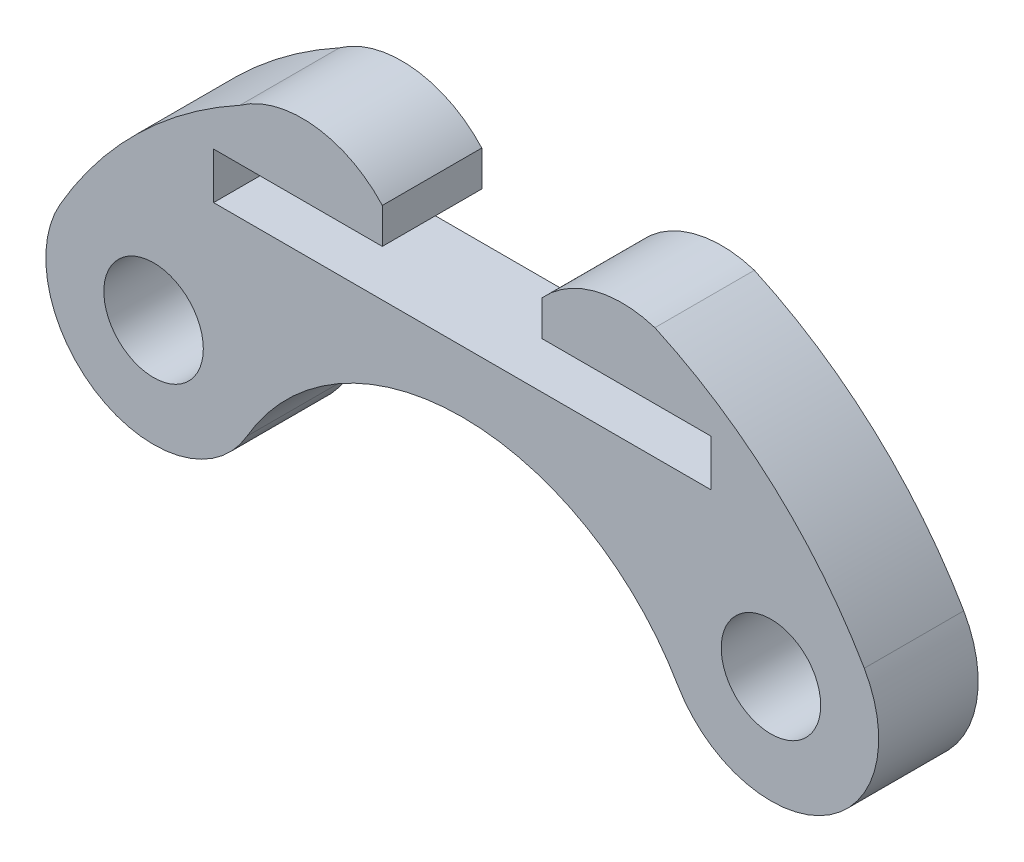
ISO-10303-21;
HEADER;
FILE_DESCRIPTION(('STEP AP214'),'2;1');
FILE_NAME('part.step','',(''),(''),'','','');
FILE_SCHEMA(('AUTOMOTIVE_DESIGN { 1 0 10303 214 1 1 1 1 }'));
ENDSEC;
DATA;
#1=APPLICATION_CONTEXT('core data for automotive mechanical design processes');
#2=APPLICATION_PROTOCOL_DEFINITION('international standard','automotive_design',2000,#1);
#3=PRODUCT_CONTEXT('',#1,'mechanical');
#4=PRODUCT('Part','Part','',(#3));
#5=PRODUCT_RELATED_PRODUCT_CATEGORY('part','',(#4));
#6=PRODUCT_DEFINITION_FORMATION('','',#4);
#7=PRODUCT_DEFINITION_CONTEXT('part definition',#1,'design');
#8=PRODUCT_DEFINITION('design','',#6,#7);
#9=PRODUCT_DEFINITION_SHAPE('','',#8);
#10=(LENGTH_UNIT() NAMED_UNIT(*) SI_UNIT(.MILLI.,.METRE.));
#11=(NAMED_UNIT(*) PLANE_ANGLE_UNIT() SI_UNIT($,.RADIAN.));
#12=(NAMED_UNIT(*) SI_UNIT($,.STERADIAN.) SOLID_ANGLE_UNIT());
#13=UNCERTAINTY_MEASURE_WITH_UNIT(LENGTH_MEASURE(1.E-05),#10,'distance_accuracy_value','');
#14=(GEOMETRIC_REPRESENTATION_CONTEXT(3) GLOBAL_UNCERTAINTY_ASSIGNED_CONTEXT((#13)) GLOBAL_UNIT_ASSIGNED_CONTEXT((#10,
#11,#12)) REPRESENTATION_CONTEXT('',''));
#15=CARTESIAN_POINT('',(0.,0.,0.));
#16=DIRECTION('',(0.,0.,1.));
#17=DIRECTION('',(1.,0.,0.));
#18=AXIS2_PLACEMENT_3D('',#15,#16,#17);
#19=CARTESIAN_POINT('',(4.82206978135494,9.64137142857506,3.));
#20=DIRECTION('',(0.,0.,1.));
#21=DIRECTION('',(1.,0.,0.));
#22=AXIS2_PLACEMENT_3D('',#19,#20,#21);
#23=PLANE('',#22);
#24=CARTESIAN_POINT('',(9.30977309067849,5.37500000000731,3.));
#25=DIRECTION('',(0.,0.,1.));
#26=DIRECTION('',(1.,0.,0.));
#27=AXIS2_PLACEMENT_3D('',#24,#25,#26);
#28=CIRCLE('',#27,1.50000000000186);
#29=CARTESIAN_POINT('',(10.8097730906803,5.37500000000731,3.));
#30=VERTEX_POINT('',#29);
#31=EDGE_CURVE('E170',#30,#30,#28,.T.);
#32=ORIENTED_EDGE('',*,*,#31,.F.);
#33=EDGE_LOOP('',(#32));
#34=FACE_BOUND('',#33,.T.);
#35=DIRECTION('',(1.,0.,0.));
#36=VECTOR('',#35,1.);
#37=CARTESIAN_POINT('',(-2.41103489067003,10.7500000000018,3.));
#38=LINE('',#37,#36);
#39=CARTESIAN_POINT('',(-7.50000000000028,10.7500000000018,3.));
#40=VERTEX_POINT('',#39);
#41=CARTESIAN_POINT('',(-2.41103489067003,10.7500000000018,3.));
#42=VERTEX_POINT('',#41);
#43=EDGE_CURVE('E193',#40,#42,#38,.T.);
#44=ORIENTED_EDGE('',*,*,#43,.T.);
#45=DIRECTION('',(0.,1.,0.));
#46=VECTOR('',#45,1.);
#47=CARTESIAN_POINT('',(-2.41103489067003,11.8206857142851,3.));
#48=LINE('',#47,#46);
#49=CARTESIAN_POINT('',(-2.41103489067003,11.8206857142851,3.));
#50=VERTEX_POINT('',#49);
#51=EDGE_CURVE('E111',#42,#50,#48,.T.);
#52=ORIENTED_EDGE('',*,*,#51,.T.);
#53=CARTESIAN_POINT('',(-4.82206978135495,9.64137142857506,3.));
#54=DIRECTION('',(0.,0.,1.));
#55=DIRECTION('',(1.,0.,0.));
#56=AXIS2_PLACEMENT_3D('',#53,#54,#55);
#57=CIRCLE('',#56,3.25);
#58=CARTESIAN_POINT('',(-6.70737151187345,12.2886601141747,3.));
#59=VERTEX_POINT('',#58);
#60=EDGE_CURVE('E226',#50,#59,#57,.T.);
#61=ORIENTED_EDGE('',*,*,#60,.T.);
#62=CARTESIAN_POINT('',(0.,0.,3.));
#63=DIRECTION('',(0.,0.,1.));
#64=DIRECTION('',(1.,0.,0.));
#65=AXIS2_PLACEMENT_3D('',#62,#63,#64);
#66=CIRCLE('',#65,14.);
#67=CARTESIAN_POINT('',(-12.1243556529876,6.99999999999057,3.));
#68=VERTEX_POINT('',#67);
#69=EDGE_CURVE('E245',#59,#68,#66,.T.);
#70=ORIENTED_EDGE('',*,*,#69,.T.);
#71=CARTESIAN_POINT('',(-9.3097730906869,5.37499999999276,3.));
#72=DIRECTION('',(0.,0.,1.));
#73=DIRECTION('',(1.,0.,0.));
#74=AXIS2_PLACEMENT_3D('',#71,#72,#73);
#75=CIRCLE('',#74,3.25);
#76=CARTESIAN_POINT('',(-6.49519052838621,3.74999999999495,3.));
#77=VERTEX_POINT('',#76);
#78=EDGE_CURVE('E242',#68,#77,#75,.T.);
#79=ORIENTED_EDGE('',*,*,#78,.T.);
#80=CARTESIAN_POINT('',(0.,0.,3.));
#81=DIRECTION('',(0.,0.,-1.));
#82=DIRECTION('',(1.,0.,0.));
#83=AXIS2_PLACEMENT_3D('',#80,#81,#82);
#84=CIRCLE('',#83,7.5);
#85=CARTESIAN_POINT('',(6.49519052838034,3.7500000000051,3.));
#86=VERTEX_POINT('',#85);
#87=EDGE_CURVE('E244',#77,#86,#84,.T.);
#88=ORIENTED_EDGE('',*,*,#87,.T.);
#89=CARTESIAN_POINT('',(9.30977309067849,5.37500000000731,3.));
#90=DIRECTION('',(0.,0.,1.));
#91=DIRECTION('',(1.,0.,0.));
#92=AXIS2_PLACEMENT_3D('',#89,#90,#91);
#93=CIRCLE('',#92,3.25);
#94=CARTESIAN_POINT('',(12.1243556529766,7.00000000000952,3.));
#95=VERTEX_POINT('',#94);
#96=EDGE_CURVE('E247',#86,#95,#93,.T.);
#97=ORIENTED_EDGE('',*,*,#96,.T.);
#98=CARTESIAN_POINT('',(0.,0.,3.));
#99=DIRECTION('',(0.,0.,1.));
#100=DIRECTION('',(1.,0.,0.));
#101=AXIS2_PLACEMENT_3D('',#98,#99,#100);
#102=CIRCLE('',#101,14.);
#103=CARTESIAN_POINT('',(5.80943087986082,12.7377593340477,3.));
#104=VERTEX_POINT('',#103);
#105=EDGE_CURVE('E253',#95,#104,#102,.T.);
#106=ORIENTED_EDGE('',*,*,#105,.T.);
#107=CARTESIAN_POINT('',(4.82206978135494,9.64137142857506,3.));
#108=DIRECTION('',(0.,0.,1.));
#109=DIRECTION('',(1.,0.,0.));
#110=AXIS2_PLACEMENT_3D('',#107,#108,#109);
#111=CIRCLE('',#110,3.25);
#112=CARTESIAN_POINT('',(2.41103489067002,11.8206857142851,3.));
#113=VERTEX_POINT('',#112);
#114=EDGE_CURVE('E255',#104,#113,#111,.T.);
#115=ORIENTED_EDGE('',*,*,#114,.T.);
#116=DIRECTION('',(0.,-1.,0.));
#117=VECTOR('',#116,1.);
#118=CARTESIAN_POINT('',(2.41103489067002,11.8206857142851,3.));
#119=LINE('',#118,#117);
#120=CARTESIAN_POINT('',(2.41103489067002,10.7500000000018,3.));
#121=VERTEX_POINT('',#120);
#122=EDGE_CURVE('E257',#113,#121,#119,.T.);
#123=ORIENTED_EDGE('',*,*,#122,.T.);
#124=DIRECTION('',(1.,0.,0.));
#125=VECTOR('',#124,1.);
#126=CARTESIAN_POINT('',(2.41103489067002,10.7500000000018,3.));
#127=LINE('',#126,#125);
#128=CARTESIAN_POINT('',(7.49999999999999,10.7500000000018,3.));
#129=VERTEX_POINT('',#128);
#130=EDGE_CURVE('E148',#121,#129,#127,.T.);
#131=ORIENTED_EDGE('',*,*,#130,.T.);
#132=DIRECTION('',(0.,-1.,0.));
#133=VECTOR('',#132,1.);
#134=CARTESIAN_POINT('',(7.49999999999999,10.7500000000018,3.));
#135=LINE('',#134,#133);
#136=CARTESIAN_POINT('',(7.49999999999999,9.3500000000018,3.));
#137=VERTEX_POINT('',#136);
#138=EDGE_CURVE('E142',#129,#137,#135,.T.);
#139=ORIENTED_EDGE('',*,*,#138,.T.);
#140=DIRECTION('',(-1.,0.,0.));
#141=VECTOR('',#140,1.);
#142=CARTESIAN_POINT('',(7.49999999999999,9.3500000000018,3.));
#143=LINE('',#142,#141);
#144=CARTESIAN_POINT('',(-7.50000000000028,9.3500000000018,3.));
#145=VERTEX_POINT('',#144);
#146=EDGE_CURVE('E146',#137,#145,#143,.T.);
#147=ORIENTED_EDGE('',*,*,#146,.T.);
#148=DIRECTION('',(0.,1.,0.));
#149=VECTOR('',#148,1.);
#150=CARTESIAN_POINT('',(-7.50000000000028,9.3500000000018,3.));
#151=LINE('',#150,#149);
#152=EDGE_CURVE('E50',#145,#40,#151,.T.);
#153=ORIENTED_EDGE('',*,*,#152,.T.);
#154=EDGE_LOOP('',(#44,#52,#61,#70,#79,#88,#97,#106,#115,#123,#131,#139,#147,#153));
#155=FACE_BOUND('',#154,.T.);
#156=CARTESIAN_POINT('',(-9.3097730906869,5.37499999999276,3.));
#157=DIRECTION('',(0.,0.,1.));
#158=DIRECTION('',(1.,0.,0.));
#159=AXIS2_PLACEMENT_3D('',#156,#157,#158);
#160=CIRCLE('',#159,1.50000000000604);
#161=CARTESIAN_POINT('',(-7.80977309068086,5.37499999999276,3.));
#162=VERTEX_POINT('',#161);
#163=EDGE_CURVE('E299',#162,#162,#160,.T.);
#164=ORIENTED_EDGE('',*,*,#163,.F.);
#165=EDGE_LOOP('',(#164));
#166=FACE_BOUND('',#165,.T.);
#167=ADVANCED_FACE('F33',(#34,#155,#166),#23,.T.);
#168=CARTESIAN_POINT('',(4.82206978135494,9.64137142857506,0.));
#169=DIRECTION('',(0.,0.,1.));
#170=DIRECTION('',(1.,0.,0.));
#171=AXIS2_PLACEMENT_3D('',#168,#169,#170);
#172=PLANE('',#171);
#173=DIRECTION('',(1.,0.,0.));
#174=VECTOR('',#173,1.);
#175=CARTESIAN_POINT('',(-2.41103489067003,10.7500000000018,0.));
#176=LINE('',#175,#174);
#177=CARTESIAN_POINT('',(-7.50000000000028,10.7500000000018,0.));
#178=VERTEX_POINT('',#177);
#179=CARTESIAN_POINT('',(-2.41103489067003,10.7500000000018,0.));
#180=VERTEX_POINT('',#179);
#181=EDGE_CURVE('E166',#178,#180,#176,.T.);
#182=ORIENTED_EDGE('',*,*,#181,.F.);
#183=DIRECTION('',(0.,1.,0.));
#184=VECTOR('',#183,1.);
#185=CARTESIAN_POINT('',(-7.50000000000028,9.3500000000018,0.));
#186=LINE('',#185,#184);
#187=CARTESIAN_POINT('',(-7.50000000000028,9.3500000000018,0.));
#188=VERTEX_POINT('',#187);
#189=EDGE_CURVE('E103',#188,#178,#186,.T.);
#190=ORIENTED_EDGE('',*,*,#189,.F.);
#191=DIRECTION('',(-1.,0.,0.));
#192=VECTOR('',#191,1.);
#193=CARTESIAN_POINT('',(7.49999999999999,9.3500000000018,0.));
#194=LINE('',#193,#192);
#195=CARTESIAN_POINT('',(7.49999999999999,9.3500000000018,0.));
#196=VERTEX_POINT('',#195);
#197=EDGE_CURVE('E97',#196,#188,#194,.T.);
#198=ORIENTED_EDGE('',*,*,#197,.F.);
#199=DIRECTION('',(0.,-1.,0.));
#200=VECTOR('',#199,1.);
#201=CARTESIAN_POINT('',(7.49999999999999,10.7500000000018,0.));
#202=LINE('',#201,#200);
#203=CARTESIAN_POINT('',(7.49999999999999,10.7500000000018,0.));
#204=VERTEX_POINT('',#203);
#205=EDGE_CURVE('E156',#204,#196,#202,.T.);
#206=ORIENTED_EDGE('',*,*,#205,.F.);
#207=DIRECTION('',(1.,0.,0.));
#208=VECTOR('',#207,1.);
#209=CARTESIAN_POINT('',(2.41103489067002,10.7500000000018,0.));
#210=LINE('',#209,#208);
#211=CARTESIAN_POINT('',(2.41103489067002,10.7500000000018,0.));
#212=VERTEX_POINT('',#211);
#213=EDGE_CURVE('E188',#212,#204,#210,.T.);
#214=ORIENTED_EDGE('',*,*,#213,.F.);
#215=DIRECTION('',(0.,-1.,0.));
#216=VECTOR('',#215,1.);
#217=CARTESIAN_POINT('',(2.41103489067002,11.8206857142851,0.));
#218=LINE('',#217,#216);
#219=CARTESIAN_POINT('',(2.41103489067002,11.8206857142851,0.));
#220=VERTEX_POINT('',#219);
#221=EDGE_CURVE('E186',#220,#212,#218,.T.);
#222=ORIENTED_EDGE('',*,*,#221,.F.);
#223=CARTESIAN_POINT('',(4.82206978135494,9.64137142857506,0.));
#224=DIRECTION('',(0.,0.,1.));
#225=DIRECTION('',(1.,0.,0.));
#226=AXIS2_PLACEMENT_3D('',#223,#224,#225);
#227=CIRCLE('',#226,3.25);
#228=CARTESIAN_POINT('',(5.80943087986082,12.7377593340477,0.));
#229=VERTEX_POINT('',#228);
#230=EDGE_CURVE('E184',#229,#220,#227,.T.);
#231=ORIENTED_EDGE('',*,*,#230,.F.);
#232=CARTESIAN_POINT('',(0.,0.,0.));
#233=DIRECTION('',(0.,0.,1.));
#234=DIRECTION('',(1.,0.,0.));
#235=AXIS2_PLACEMENT_3D('',#232,#233,#234);
#236=CIRCLE('',#235,14.);
#237=CARTESIAN_POINT('',(12.1243556529766,7.00000000000952,0.));
#238=VERTEX_POINT('',#237);
#239=EDGE_CURVE('E182',#238,#229,#236,.T.);
#240=ORIENTED_EDGE('',*,*,#239,.F.);
#241=CARTESIAN_POINT('',(9.30977309067849,5.37500000000731,0.));
#242=DIRECTION('',(0.,0.,1.));
#243=DIRECTION('',(1.,0.,0.));
#244=AXIS2_PLACEMENT_3D('',#241,#242,#243);
#245=CIRCLE('',#244,3.25);
#246=CARTESIAN_POINT('',(6.49519052838034,3.7500000000051,0.));
#247=VERTEX_POINT('',#246);
#248=EDGE_CURVE('E180',#247,#238,#245,.T.);
#249=ORIENTED_EDGE('',*,*,#248,.F.);
#250=CARTESIAN_POINT('',(0.,0.,0.));
#251=DIRECTION('',(0.,0.,-1.));
#252=DIRECTION('',(1.,0.,0.));
#253=AXIS2_PLACEMENT_3D('',#250,#251,#252);
#254=CIRCLE('',#253,7.5);
#255=CARTESIAN_POINT('',(-6.49519052838621,3.74999999999495,0.));
#256=VERTEX_POINT('',#255);
#257=EDGE_CURVE('E178',#256,#247,#254,.T.);
#258=ORIENTED_EDGE('',*,*,#257,.F.);
#259=CARTESIAN_POINT('',(-9.3097730906869,5.37499999999276,0.));
#260=DIRECTION('',(0.,0.,1.));
#261=DIRECTION('',(1.,0.,0.));
#262=AXIS2_PLACEMENT_3D('',#259,#260,#261);
#263=CIRCLE('',#262,3.25);
#264=CARTESIAN_POINT('',(-12.1243556529876,6.99999999999057,0.));
#265=VERTEX_POINT('',#264);
#266=EDGE_CURVE('E176',#265,#256,#263,.T.);
#267=ORIENTED_EDGE('',*,*,#266,.F.);
#268=CARTESIAN_POINT('',(0.,0.,0.));
#269=DIRECTION('',(0.,0.,1.));
#270=DIRECTION('',(1.,0.,0.));
#271=AXIS2_PLACEMENT_3D('',#268,#269,#270);
#272=CIRCLE('',#271,14.);
#273=CARTESIAN_POINT('',(-6.70737151187345,12.2886601141747,0.));
#274=VERTEX_POINT('',#273);
#275=EDGE_CURVE('E174',#274,#265,#272,.T.);
#276=ORIENTED_EDGE('',*,*,#275,.F.);
#277=CARTESIAN_POINT('',(-4.82206978135495,9.64137142857506,0.));
#278=DIRECTION('',(0.,0.,1.));
#279=DIRECTION('',(1.,0.,0.));
#280=AXIS2_PLACEMENT_3D('',#277,#278,#279);
#281=CIRCLE('',#280,3.25);
#282=CARTESIAN_POINT('',(-2.41103489067003,11.8206857142851,0.));
#283=VERTEX_POINT('',#282);
#284=EDGE_CURVE('E172',#283,#274,#281,.T.);
#285=ORIENTED_EDGE('',*,*,#284,.F.);
#286=DIRECTION('',(0.,1.,0.));
#287=VECTOR('',#286,1.);
#288=CARTESIAN_POINT('',(-2.41103489067003,11.8206857142851,0.));
#289=LINE('',#288,#287);
#290=EDGE_CURVE('E169',#180,#283,#289,.T.);
#291=ORIENTED_EDGE('',*,*,#290,.F.);
#292=EDGE_LOOP('',(#182,#190,#198,#206,#214,#222,#231,#240,#249,#258,#267,#276,#285,#291));
#293=FACE_BOUND('',#292,.T.);
#294=CARTESIAN_POINT('',(9.30977309067849,5.37500000000731,0.));
#295=DIRECTION('',(0.,0.,1.));
#296=DIRECTION('',(1.,0.,0.));
#297=AXIS2_PLACEMENT_3D('',#294,#295,#296);
#298=CIRCLE('',#297,1.50000000000186);
#299=CARTESIAN_POINT('',(10.8097730906803,5.37500000000731,0.));
#300=VERTEX_POINT('',#299);
#301=EDGE_CURVE('E305',#300,#300,#298,.T.);
#302=ORIENTED_EDGE('',*,*,#301,.T.);
#303=EDGE_LOOP('',(#302));
#304=FACE_BOUND('',#303,.T.);
#305=CARTESIAN_POINT('',(-9.3097730906869,5.37499999999276,0.));
#306=DIRECTION('',(0.,0.,1.));
#307=DIRECTION('',(1.,0.,0.));
#308=AXIS2_PLACEMENT_3D('',#305,#306,#307);
#309=CIRCLE('',#308,1.50000000000604);
#310=CARTESIAN_POINT('',(-7.80977309068086,5.37499999999276,0.));
#311=VERTEX_POINT('',#310);
#312=EDGE_CURVE('E302',#311,#311,#309,.T.);
#313=ORIENTED_EDGE('',*,*,#312,.T.);
#314=EDGE_LOOP('',(#313));
#315=FACE_BOUND('',#314,.T.);
#316=ADVANCED_FACE('F230',(#293,#304,#315),#172,.F.);
#317=CARTESIAN_POINT('',(-2.41103489067003,10.7500000000018,3.));
#318=DIRECTION('',(0.,1.,0.));
#319=DIRECTION('',(-1.,0.,0.));
#320=AXIS2_PLACEMENT_3D('',#317,#318,#319);
#321=PLANE('',#320);
#322=ORIENTED_EDGE('',*,*,#181,.T.);
#323=DIRECTION('',(0.,0.,-1.));
#324=VECTOR('',#323,1.);
#325=CARTESIAN_POINT('',(-2.41103489067003,10.7500000000018,3.));
#326=LINE('',#325,#324);
#327=EDGE_CURVE('E11',#42,#180,#326,.T.);
#328=ORIENTED_EDGE('',*,*,#327,.F.);
#329=ORIENTED_EDGE('',*,*,#43,.F.);
#330=DIRECTION('',(0.,0.,-1.));
#331=VECTOR('',#330,1.);
#332=CARTESIAN_POINT('',(-7.50000000000028,10.7500000000018,3.));
#333=LINE('',#332,#331);
#334=EDGE_CURVE('E162',#40,#178,#333,.T.);
#335=ORIENTED_EDGE('',*,*,#334,.T.);
#336=EDGE_LOOP('',(#322,#328,#329,#335));
#337=FACE_BOUND('',#336,.T.);
#338=ADVANCED_FACE('F35',(#337),#321,.F.);
#339=CARTESIAN_POINT('',(-2.41103489067003,11.8206857142851,3.));
#340=DIRECTION('',(-1.,0.,0.));
#341=DIRECTION('',(0.,0.,1.));
#342=AXIS2_PLACEMENT_3D('',#339,#340,#341);
#343=PLANE('',#342);
#344=ORIENTED_EDGE('',*,*,#290,.T.);
#345=DIRECTION('',(0.,0.,-1.));
#346=VECTOR('',#345,1.);
#347=CARTESIAN_POINT('',(-2.41103489067003,11.8206857142851,3.));
#348=LINE('',#347,#346);
#349=EDGE_CURVE('E42',#50,#283,#348,.T.);
#350=ORIENTED_EDGE('',*,*,#349,.F.);
#351=ORIENTED_EDGE('',*,*,#51,.F.);
#352=ORIENTED_EDGE('',*,*,#327,.T.);
#353=EDGE_LOOP('',(#344,#350,#351,#352));
#354=FACE_BOUND('',#353,.T.);
#355=ADVANCED_FACE('F418',(#354),#343,.F.);
#356=CARTESIAN_POINT('',(-4.82206978135495,9.64137142857506,3.));
#357=DIRECTION('',(0.,0.,-1.));
#358=DIRECTION('',(-1.,0.,0.));
#359=AXIS2_PLACEMENT_3D('',#356,#357,#358);
#360=CYLINDRICAL_SURFACE('',#359,3.25);
#361=ORIENTED_EDGE('',*,*,#284,.T.);
#362=DIRECTION('',(0.,0.,-1.));
#363=VECTOR('',#362,1.);
#364=CARTESIAN_POINT('',(-6.70737151187345,12.2886601141747,3.));
#365=LINE('',#364,#363);
#366=EDGE_CURVE('E218',#59,#274,#365,.T.);
#367=ORIENTED_EDGE('',*,*,#366,.F.);
#368=ORIENTED_EDGE('',*,*,#60,.F.);
#369=ORIENTED_EDGE('',*,*,#349,.T.);
#370=EDGE_LOOP('',(#361,#367,#368,#369));
#371=FACE_BOUND('',#370,.T.);
#372=ADVANCED_FACE('F224',(#371),#360,.T.);
#373=CARTESIAN_POINT('',(0.,0.,3.));
#374=DIRECTION('',(0.,0.,-1.));
#375=DIRECTION('',(-1.,0.,0.));
#376=AXIS2_PLACEMENT_3D('',#373,#374,#375);
#377=CYLINDRICAL_SURFACE('',#376,14.);
#378=ORIENTED_EDGE('',*,*,#275,.T.);
#379=DIRECTION('',(0.,0.,-1.));
#380=VECTOR('',#379,1.);
#381=CARTESIAN_POINT('',(-12.1243556529876,6.99999999999057,3.));
#382=LINE('',#381,#380);
#383=EDGE_CURVE('E215',#68,#265,#382,.T.);
#384=ORIENTED_EDGE('',*,*,#383,.F.);
#385=ORIENTED_EDGE('',*,*,#69,.F.);
#386=ORIENTED_EDGE('',*,*,#366,.T.);
#387=EDGE_LOOP('',(#378,#384,#385,#386));
#388=FACE_BOUND('',#387,.T.);
#389=ADVANCED_FACE('F236',(#388),#377,.T.);
#390=CARTESIAN_POINT('',(-9.3097730906869,5.37499999999276,3.));
#391=DIRECTION('',(0.,0.,-1.));
#392=DIRECTION('',(-1.,0.,0.));
#393=AXIS2_PLACEMENT_3D('',#390,#391,#392);
#394=CYLINDRICAL_SURFACE('',#393,3.25);
#395=ORIENTED_EDGE('',*,*,#266,.T.);
#396=DIRECTION('',(0.,0.,-1.));
#397=VECTOR('',#396,1.);
#398=CARTESIAN_POINT('',(-6.49519052838621,3.74999999999495,3.));
#399=LINE('',#398,#397);
#400=EDGE_CURVE('E212',#77,#256,#399,.T.);
#401=ORIENTED_EDGE('',*,*,#400,.F.);
#402=ORIENTED_EDGE('',*,*,#78,.F.);
#403=ORIENTED_EDGE('',*,*,#383,.T.);
#404=EDGE_LOOP('',(#395,#401,#402,#403));
#405=FACE_BOUND('',#404,.T.);
#406=ADVANCED_FACE('F240',(#405),#394,.T.);
#407=CARTESIAN_POINT('',(0.,0.,3.));
#408=DIRECTION('',(0.,0.,-1.));
#409=DIRECTION('',(-1.,0.,0.));
#410=AXIS2_PLACEMENT_3D('',#407,#408,#409);
#411=CYLINDRICAL_SURFACE('',#410,7.5);
#412=ORIENTED_EDGE('',*,*,#257,.T.);
#413=DIRECTION('',(0.,0.,-1.));
#414=VECTOR('',#413,1.);
#415=CARTESIAN_POINT('',(6.49519052838034,3.7500000000051,3.));
#416=LINE('',#415,#414);
#417=EDGE_CURVE('E209',#86,#247,#416,.T.);
#418=ORIENTED_EDGE('',*,*,#417,.F.);
#419=ORIENTED_EDGE('',*,*,#87,.F.);
#420=ORIENTED_EDGE('',*,*,#400,.T.);
#421=EDGE_LOOP('',(#412,#418,#419,#420));
#422=FACE_BOUND('',#421,.T.);
#423=ADVANCED_FACE('F383',(#422),#411,.F.);
#424=CARTESIAN_POINT('',(9.30977309067849,5.37500000000731,3.));
#425=DIRECTION('',(0.,0.,-1.));
#426=DIRECTION('',(-1.,0.,0.));
#427=AXIS2_PLACEMENT_3D('',#424,#425,#426);
#428=CYLINDRICAL_SURFACE('',#427,3.25);
#429=ORIENTED_EDGE('',*,*,#248,.T.);
#430=DIRECTION('',(0.,0.,-1.));
#431=VECTOR('',#430,1.);
#432=CARTESIAN_POINT('',(12.1243556529766,7.00000000000952,3.));
#433=LINE('',#432,#431);
#434=EDGE_CURVE('E206',#95,#238,#433,.T.);
#435=ORIENTED_EDGE('',*,*,#434,.F.);
#436=ORIENTED_EDGE('',*,*,#96,.F.);
#437=ORIENTED_EDGE('',*,*,#417,.T.);
#438=EDGE_LOOP('',(#429,#435,#436,#437));
#439=FACE_BOUND('',#438,.T.);
#440=ADVANCED_FACE('F373',(#439),#428,.T.);
#441=CARTESIAN_POINT('',(0.,0.,3.));
#442=DIRECTION('',(0.,0.,-1.));
#443=DIRECTION('',(-1.,0.,0.));
#444=AXIS2_PLACEMENT_3D('',#441,#442,#443);
#445=CYLINDRICAL_SURFACE('',#444,14.);
#446=ORIENTED_EDGE('',*,*,#239,.T.);
#447=DIRECTION('',(0.,0.,-1.));
#448=VECTOR('',#447,1.);
#449=CARTESIAN_POINT('',(5.80943087986082,12.7377593340477,3.));
#450=LINE('',#449,#448);
#451=EDGE_CURVE('E203',#104,#229,#450,.T.);
#452=ORIENTED_EDGE('',*,*,#451,.F.);
#453=ORIENTED_EDGE('',*,*,#105,.F.);
#454=ORIENTED_EDGE('',*,*,#434,.T.);
#455=EDGE_LOOP('',(#446,#452,#453,#454));
#456=FACE_BOUND('',#455,.T.);
#457=ADVANCED_FACE('F363',(#456),#445,.T.);
#458=CARTESIAN_POINT('',(4.82206978135494,9.64137142857506,3.));
#459=DIRECTION('',(0.,0.,-1.));
#460=DIRECTION('',(-1.,0.,0.));
#461=AXIS2_PLACEMENT_3D('',#458,#459,#460);
#462=CYLINDRICAL_SURFACE('',#461,3.25);
#463=ORIENTED_EDGE('',*,*,#230,.T.);
#464=DIRECTION('',(0.,0.,-1.));
#465=VECTOR('',#464,1.);
#466=CARTESIAN_POINT('',(2.41103489067002,11.8206857142851,3.));
#467=LINE('',#466,#465);
#468=EDGE_CURVE('E200',#113,#220,#467,.T.);
#469=ORIENTED_EDGE('',*,*,#468,.F.);
#470=ORIENTED_EDGE('',*,*,#114,.F.);
#471=ORIENTED_EDGE('',*,*,#451,.T.);
#472=EDGE_LOOP('',(#463,#469,#470,#471));
#473=FACE_BOUND('',#472,.T.);
#474=ADVANCED_FACE('F354',(#473),#462,.T.);
#475=CARTESIAN_POINT('',(2.41103489067002,11.8206857142851,3.));
#476=DIRECTION('',(1.,0.,0.));
#477=DIRECTION('',(0.,1.,0.));
#478=AXIS2_PLACEMENT_3D('',#475,#476,#477);
#479=PLANE('',#478);
#480=ORIENTED_EDGE('',*,*,#221,.T.);
#481=DIRECTION('',(0.,0.,-1.));
#482=VECTOR('',#481,1.);
#483=CARTESIAN_POINT('',(2.41103489067002,10.7500000000018,3.));
#484=LINE('',#483,#482);
#485=EDGE_CURVE('E197',#121,#212,#484,.T.);
#486=ORIENTED_EDGE('',*,*,#485,.F.);
#487=ORIENTED_EDGE('',*,*,#122,.F.);
#488=ORIENTED_EDGE('',*,*,#468,.T.);
#489=EDGE_LOOP('',(#480,#486,#487,#488));
#490=FACE_BOUND('',#489,.T.);
#491=ADVANCED_FACE('F263',(#490),#479,.F.);
#492=CARTESIAN_POINT('',(2.41103489067002,10.7500000000018,3.));
#493=DIRECTION('',(0.,1.,0.));
#494=DIRECTION('',(0.,0.,1.));
#495=AXIS2_PLACEMENT_3D('',#492,#493,#494);
#496=PLANE('',#495);
#497=ORIENTED_EDGE('',*,*,#213,.T.);
#498=DIRECTION('',(0.,0.,-1.));
#499=VECTOR('',#498,1.);
#500=CARTESIAN_POINT('',(7.49999999999999,10.7500000000018,3.));
#501=LINE('',#500,#499);
#502=EDGE_CURVE('E157',#129,#204,#501,.T.);
#503=ORIENTED_EDGE('',*,*,#502,.F.);
#504=ORIENTED_EDGE('',*,*,#130,.F.);
#505=ORIENTED_EDGE('',*,*,#485,.T.);
#506=EDGE_LOOP('',(#497,#503,#504,#505));
#507=FACE_BOUND('',#506,.T.);
#508=ADVANCED_FACE('F267',(#507),#496,.F.);
#509=CARTESIAN_POINT('',(7.49999999999999,10.7500000000018,3.));
#510=DIRECTION('',(1.,0.,0.));
#511=DIRECTION('',(0.,0.,-1.));
#512=AXIS2_PLACEMENT_3D('',#509,#510,#511);
#513=PLANE('',#512);
#514=ORIENTED_EDGE('',*,*,#205,.T.);
#515=DIRECTION('',(0.,0.,-1.));
#516=VECTOR('',#515,1.);
#517=CARTESIAN_POINT('',(7.49999999999999,9.3500000000018,3.));
#518=LINE('',#517,#516);
#519=EDGE_CURVE('E153',#137,#196,#518,.T.);
#520=ORIENTED_EDGE('',*,*,#519,.F.);
#521=ORIENTED_EDGE('',*,*,#138,.F.);
#522=ORIENTED_EDGE('',*,*,#502,.T.);
#523=EDGE_LOOP('',(#514,#520,#521,#522));
#524=FACE_BOUND('',#523,.T.);
#525=ADVANCED_FACE('F154',(#524),#513,.F.);
#526=CARTESIAN_POINT('',(7.49999999999999,9.3500000000018,3.));
#527=DIRECTION('',(0.,-1.,0.));
#528=DIRECTION('',(1.,0.,0.));
#529=AXIS2_PLACEMENT_3D('',#526,#527,#528);
#530=PLANE('',#529);
#531=ORIENTED_EDGE('',*,*,#197,.T.);
#532=DIRECTION('',(0.,0.,-1.));
#533=VECTOR('',#532,1.);
#534=CARTESIAN_POINT('',(-7.50000000000028,9.3500000000018,3.));
#535=LINE('',#534,#533);
#536=EDGE_CURVE('E158',#145,#188,#535,.T.);
#537=ORIENTED_EDGE('',*,*,#536,.F.);
#538=ORIENTED_EDGE('',*,*,#146,.F.);
#539=ORIENTED_EDGE('',*,*,#519,.T.);
#540=EDGE_LOOP('',(#531,#537,#538,#539));
#541=FACE_BOUND('',#540,.T.);
#542=ADVANCED_FACE('F160',(#541),#530,.F.);
#543=CARTESIAN_POINT('',(-7.50000000000028,9.3500000000018,3.));
#544=DIRECTION('',(-1.,0.,0.));
#545=DIRECTION('',(0.,0.,1.));
#546=AXIS2_PLACEMENT_3D('',#543,#544,#545);
#547=PLANE('',#546);
#548=ORIENTED_EDGE('',*,*,#189,.T.);
#549=ORIENTED_EDGE('',*,*,#334,.F.);
#550=ORIENTED_EDGE('',*,*,#152,.F.);
#551=ORIENTED_EDGE('',*,*,#536,.T.);
#552=EDGE_LOOP('',(#548,#549,#550,#551));
#553=FACE_BOUND('',#552,.T.);
#554=ADVANCED_FACE('F271',(#553),#547,.F.);
#555=CARTESIAN_POINT('',(9.30977309067849,5.37500000000731,3.));
#556=DIRECTION('',(0.,0.,-1.));
#557=DIRECTION('',(-1.,0.,0.));
#558=AXIS2_PLACEMENT_3D('',#555,#556,#557);
#559=CYLINDRICAL_SURFACE('',#558,1.50000000000186);
#560=ORIENTED_EDGE('',*,*,#31,.T.);
#561=EDGE_LOOP('',(#560));
#562=FACE_BOUND('',#561,.T.);
#563=ORIENTED_EDGE('',*,*,#301,.F.);
#564=EDGE_LOOP('',(#563));
#565=FACE_BOUND('',#564,.T.);
#566=ADVANCED_FACE('F273',(#562,#565),#559,.F.);
#567=CARTESIAN_POINT('',(-9.3097730906869,5.37499999999276,3.));
#568=DIRECTION('',(0.,0.,-1.));
#569=DIRECTION('',(-1.,0.,0.));
#570=AXIS2_PLACEMENT_3D('',#567,#568,#569);
#571=CYLINDRICAL_SURFACE('',#570,1.50000000000604);
#572=ORIENTED_EDGE('',*,*,#163,.T.);
#573=EDGE_LOOP('',(#572));
#574=FACE_BOUND('',#573,.T.);
#575=ORIENTED_EDGE('',*,*,#312,.F.);
#576=EDGE_LOOP('',(#575));
#577=FACE_BOUND('',#576,.T.);
#578=ADVANCED_FACE('F279',(#574,#577),#571,.F.);
#579=CLOSED_SHELL('',(#167,#316,#338,#355,#372,#389,#406,#423,#440,#457,#474,#491,#508,#525,
#542,#554,#566,#578));
#580=MANIFOLD_SOLID_BREP('B2',#579);
#581=ADVANCED_BREP_SHAPE_REPRESENTATION('',(#18,#580),#14);
#582=SHAPE_DEFINITION_REPRESENTATION(#9,#581);
ENDSEC;
END-ISO-10303-21;
